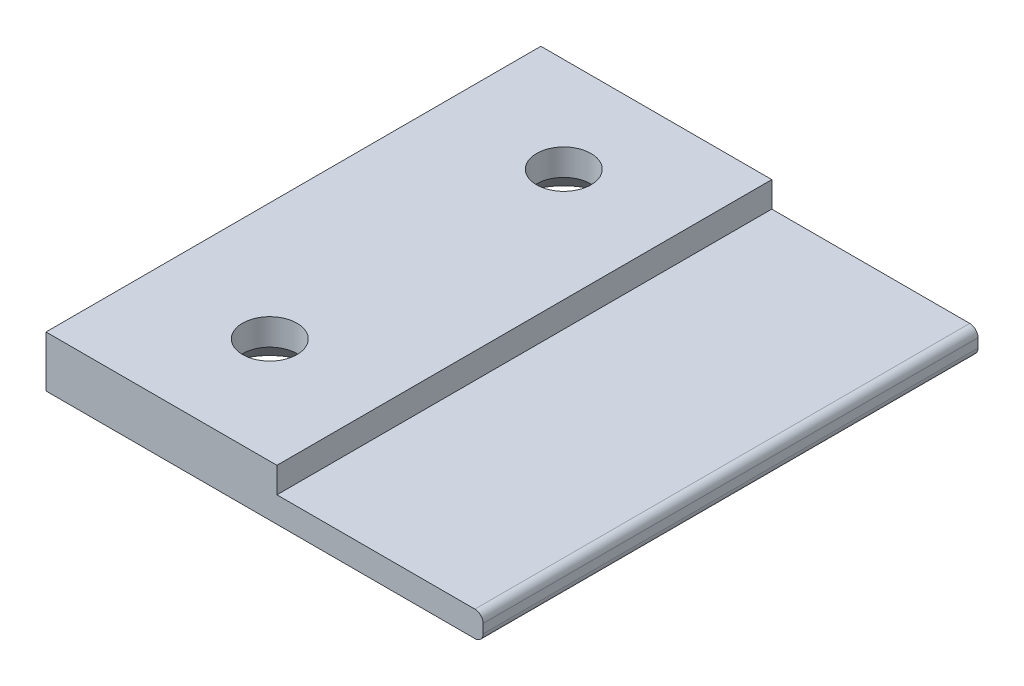
ISO-10303-21;
HEADER;
FILE_DESCRIPTION(('STEP AP214'),'2;1');
FILE_NAME('part.step','',(''),(''),'','','');
FILE_SCHEMA(('AUTOMOTIVE_DESIGN { 1 0 10303 214 1 1 1 1 }'));
ENDSEC;
DATA;
#1=APPLICATION_CONTEXT('core data for automotive mechanical design processes');
#2=APPLICATION_PROTOCOL_DEFINITION('international standard','automotive_design',2000,#1);
#3=PRODUCT_CONTEXT('',#1,'mechanical');
#4=PRODUCT('Part','Part','',(#3));
#5=PRODUCT_RELATED_PRODUCT_CATEGORY('part','',(#4));
#6=PRODUCT_DEFINITION_FORMATION('','',#4);
#7=PRODUCT_DEFINITION_CONTEXT('part definition',#1,'design');
#8=PRODUCT_DEFINITION('design','',#6,#7);
#9=PRODUCT_DEFINITION_SHAPE('','',#8);
#10=(LENGTH_UNIT() NAMED_UNIT(*) SI_UNIT(.MILLI.,.METRE.));
#11=(NAMED_UNIT(*) PLANE_ANGLE_UNIT() SI_UNIT($,.RADIAN.));
#12=(NAMED_UNIT(*) SI_UNIT($,.STERADIAN.) SOLID_ANGLE_UNIT());
#13=UNCERTAINTY_MEASURE_WITH_UNIT(LENGTH_MEASURE(1.E-05),#10,'distance_accuracy_value','');
#14=(GEOMETRIC_REPRESENTATION_CONTEXT(3) GLOBAL_UNCERTAINTY_ASSIGNED_CONTEXT((#13)) GLOBAL_UNIT_ASSIGNED_CONTEXT((#10,
#11,#12)) REPRESENTATION_CONTEXT('',''));
#15=CARTESIAN_POINT('',(0.,0.,0.));
#16=DIRECTION('',(0.,0.,1.));
#17=DIRECTION('',(1.,0.,0.));
#18=AXIS2_PLACEMENT_3D('',#15,#16,#17);
#19=CARTESIAN_POINT('',(0.,-6.2,60.));
#20=DIRECTION('',(1.,0.,0.));
#21=DIRECTION('',(0.,0.,-1.));
#22=AXIS2_PLACEMENT_3D('',#19,#20,#21);
#23=PLANE('',#22);
#24=DIRECTION('',(0.,-1.,0.));
#25=VECTOR('',#24,1.);
#26=CARTESIAN_POINT('',(0.,-6.2,0.));
#27=LINE('',#26,#25);
#28=CARTESIAN_POINT('',(0.,0.,0.));
#29=VERTEX_POINT('',#28);
#30=CARTESIAN_POINT('',(0.,-6.2,0.));
#31=VERTEX_POINT('',#30);
#32=EDGE_CURVE('E123',#29,#31,#27,.T.);
#33=ORIENTED_EDGE('',*,*,#32,.T.);
#34=DIRECTION('',(0.,0.,-1.));
#35=VECTOR('',#34,1.);
#36=CARTESIAN_POINT('',(0.,-6.2,60.));
#37=LINE('',#36,#35);
#38=CARTESIAN_POINT('',(0.,-6.2,60.));
#39=VERTEX_POINT('',#38);
#40=EDGE_CURVE('E106',#39,#31,#37,.T.);
#41=ORIENTED_EDGE('',*,*,#40,.F.);
#42=DIRECTION('',(0.,-1.,0.));
#43=VECTOR('',#42,1.);
#44=CARTESIAN_POINT('',(0.,-6.2,60.));
#45=LINE('',#44,#43);
#46=CARTESIAN_POINT('',(0.,0.,60.));
#47=VERTEX_POINT('',#46);
#48=EDGE_CURVE('E111',#47,#39,#45,.T.);
#49=ORIENTED_EDGE('',*,*,#48,.F.);
#50=DIRECTION('',(0.,0.,-1.));
#51=VECTOR('',#50,1.);
#52=CARTESIAN_POINT('',(0.,0.,60.));
#53=LINE('',#52,#51);
#54=EDGE_CURVE('E165',#47,#29,#53,.T.);
#55=ORIENTED_EDGE('',*,*,#54,.T.);
#56=EDGE_LOOP('',(#33,#41,#49,#55));
#57=FACE_BOUND('',#56,.T.);
#58=ADVANCED_FACE('F36',(#57),#23,.F.);
#59=CARTESIAN_POINT('',(53.,-6.2,60.));
#60=DIRECTION('',(0.,1.,0.));
#61=DIRECTION('',(0.,0.,1.));
#62=AXIS2_PLACEMENT_3D('',#59,#60,#61);
#63=PLANE('',#62);
#64=CARTESIAN_POINT('',(14.293755615536,-6.2,11.5151442867863));
#65=DIRECTION('',(0.,-1.,0.));
#66=DIRECTION('',(0.,0.,-1.));
#67=AXIS2_PLACEMENT_3D('',#64,#65,#66);
#68=CIRCLE('',#67,6.3);
#69=CARTESIAN_POINT('',(14.293755615536,-6.2,5.21514428678633));
#70=VERTEX_POINT('',#69);
#71=EDGE_CURVE('E249',#70,#70,#68,.T.);
#72=ORIENTED_EDGE('',*,*,#71,.F.);
#73=EDGE_LOOP('',(#72));
#74=FACE_BOUND('',#73,.T.);
#75=CARTESIAN_POINT('',(14.293755615536,-6.2,47.1589377928567));
#76=DIRECTION('',(0.,-1.,0.));
#77=DIRECTION('',(0.,0.,-1.));
#78=AXIS2_PLACEMENT_3D('',#75,#76,#77);
#79=CIRCLE('',#78,6.3);
#80=CARTESIAN_POINT('',(14.293755615536,-6.2,40.8589377928567));
#81=VERTEX_POINT('',#80);
#82=EDGE_CURVE('E152',#81,#81,#79,.T.);
#83=ORIENTED_EDGE('',*,*,#82,.F.);
#84=EDGE_LOOP('',(#83));
#85=FACE_BOUND('',#84,.T.);
#86=DIRECTION('',(1.,0.,0.));
#87=VECTOR('',#86,1.);
#88=CARTESIAN_POINT('',(53.,-6.2,0.));
#89=LINE('',#88,#87);
#90=CARTESIAN_POINT('',(52.,-6.2,0.));
#91=VERTEX_POINT('',#90);
#92=EDGE_CURVE('E149',#31,#91,#89,.T.);
#93=ORIENTED_EDGE('',*,*,#92,.T.);
#94=DIRECTION('',(0.,0.,-1.));
#95=VECTOR('',#94,1.);
#96=CARTESIAN_POINT('',(52.,-6.2,60.));
#97=LINE('',#96,#95);
#98=CARTESIAN_POINT('',(52.,-6.2,60.));
#99=VERTEX_POINT('',#98);
#100=EDGE_CURVE('E11',#91,#99,#97,.F.);
#101=ORIENTED_EDGE('',*,*,#100,.T.);
#102=DIRECTION('',(1.,0.,0.));
#103=VECTOR('',#102,1.);
#104=CARTESIAN_POINT('',(53.,-6.2,60.));
#105=LINE('',#104,#103);
#106=EDGE_CURVE('E102',#39,#99,#105,.T.);
#107=ORIENTED_EDGE('',*,*,#106,.F.);
#108=ORIENTED_EDGE('',*,*,#40,.T.);
#109=EDGE_LOOP('',(#93,#101,#107,#108));
#110=FACE_BOUND('',#109,.T.);
#111=ADVANCED_FACE('F104',(#74,#85,#110),#63,.F.);
#112=CARTESIAN_POINT('',(53.,-3.1,60.));
#113=DIRECTION('',(-1.,0.,0.));
#114=DIRECTION('',(0.,0.,1.));
#115=AXIS2_PLACEMENT_3D('',#112,#113,#114);
#116=PLANE('',#115);
#117=DIRECTION('',(0.,1.,0.));
#118=VECTOR('',#117,1.);
#119=CARTESIAN_POINT('',(53.,-3.1,0.));
#120=LINE('',#119,#118);
#121=CARTESIAN_POINT('',(53.,-5.2,0.));
#122=VERTEX_POINT('',#121);
#123=CARTESIAN_POINT('',(53.,-4.1,0.));
#124=VERTEX_POINT('',#123);
#125=EDGE_CURVE('E168',#122,#124,#120,.T.);
#126=ORIENTED_EDGE('',*,*,#125,.T.);
#127=DIRECTION('',(0.,0.,-1.));
#128=VECTOR('',#127,1.);
#129=CARTESIAN_POINT('',(53.,-4.1,60.));
#130=LINE('',#129,#128);
#131=CARTESIAN_POINT('',(53.,-4.1,60.));
#132=VERTEX_POINT('',#131);
#133=EDGE_CURVE('E59',#124,#132,#130,.F.);
#134=ORIENTED_EDGE('',*,*,#133,.T.);
#135=DIRECTION('',(0.,1.,0.));
#136=VECTOR('',#135,1.);
#137=CARTESIAN_POINT('',(53.,-3.1,60.));
#138=LINE('',#137,#136);
#139=CARTESIAN_POINT('',(53.,-5.2,60.));
#140=VERTEX_POINT('',#139);
#141=EDGE_CURVE('E110',#140,#132,#138,.T.);
#142=ORIENTED_EDGE('',*,*,#141,.F.);
#143=DIRECTION('',(0.,0.,-1.));
#144=VECTOR('',#143,1.);
#145=CARTESIAN_POINT('',(53.,-5.2,60.));
#146=LINE('',#145,#144);
#147=EDGE_CURVE('E138',#140,#122,#146,.T.);
#148=ORIENTED_EDGE('',*,*,#147,.T.);
#149=EDGE_LOOP('',(#126,#134,#142,#148));
#150=FACE_BOUND('',#149,.T.);
#151=ADVANCED_FACE('F190',(#150),#116,.F.);
#152=CARTESIAN_POINT('',(28.,-3.1,60.));
#153=DIRECTION('',(0.,-1.,0.));
#154=DIRECTION('',(0.,0.,-1.));
#155=AXIS2_PLACEMENT_3D('',#152,#153,#154);
#156=PLANE('',#155);
#157=DIRECTION('',(-1.,0.,0.));
#158=VECTOR('',#157,1.);
#159=CARTESIAN_POINT('',(28.,-3.1,60.));
#160=LINE('',#159,#158);
#161=CARTESIAN_POINT('',(52.,-3.1,60.));
#162=VERTEX_POINT('',#161);
#163=CARTESIAN_POINT('',(28.,-3.1,60.));
#164=VERTEX_POINT('',#163);
#165=EDGE_CURVE('E161',#162,#164,#160,.T.);
#166=ORIENTED_EDGE('',*,*,#165,.F.);
#167=DIRECTION('',(0.,0.,-1.));
#168=VECTOR('',#167,1.);
#169=CARTESIAN_POINT('',(52.,-3.1,60.));
#170=LINE('',#169,#168);
#171=CARTESIAN_POINT('',(52.,-3.1,0.));
#172=VERTEX_POINT('',#171);
#173=EDGE_CURVE('E124',#162,#172,#170,.T.);
#174=ORIENTED_EDGE('',*,*,#173,.T.);
#175=DIRECTION('',(-1.,0.,0.));
#176=VECTOR('',#175,1.);
#177=CARTESIAN_POINT('',(28.,-3.1,0.));
#178=LINE('',#177,#176);
#179=CARTESIAN_POINT('',(28.,-3.1,0.));
#180=VERTEX_POINT('',#179);
#181=EDGE_CURVE('E170',#172,#180,#178,.T.);
#182=ORIENTED_EDGE('',*,*,#181,.T.);
#183=DIRECTION('',(0.,0.,-1.));
#184=VECTOR('',#183,1.);
#185=CARTESIAN_POINT('',(28.,-3.1,60.));
#186=LINE('',#185,#184);
#187=EDGE_CURVE('E125',#164,#180,#186,.T.);
#188=ORIENTED_EDGE('',*,*,#187,.F.);
#189=EDGE_LOOP('',(#166,#174,#182,#188));
#190=FACE_BOUND('',#189,.T.);
#191=ADVANCED_FACE('F196',(#190),#156,.F.);
#192=CARTESIAN_POINT('',(28.,0.,60.));
#193=DIRECTION('',(-1.,0.,0.));
#194=DIRECTION('',(0.,0.,1.));
#195=AXIS2_PLACEMENT_3D('',#192,#193,#194);
#196=PLANE('',#195);
#197=DIRECTION('',(0.,1.,0.));
#198=VECTOR('',#197,1.);
#199=CARTESIAN_POINT('',(28.,0.,0.));
#200=LINE('',#199,#198);
#201=CARTESIAN_POINT('',(28.,0.,0.));
#202=VERTEX_POINT('',#201);
#203=EDGE_CURVE('E172',#180,#202,#200,.T.);
#204=ORIENTED_EDGE('',*,*,#203,.T.);
#205=DIRECTION('',(0.,0.,-1.));
#206=VECTOR('',#205,1.);
#207=CARTESIAN_POINT('',(28.,0.,60.));
#208=LINE('',#207,#206);
#209=CARTESIAN_POINT('',(28.,0.,60.));
#210=VERTEX_POINT('',#209);
#211=EDGE_CURVE('E131',#210,#202,#208,.T.);
#212=ORIENTED_EDGE('',*,*,#211,.F.);
#213=DIRECTION('',(0.,1.,0.));
#214=VECTOR('',#213,1.);
#215=CARTESIAN_POINT('',(28.,0.,60.));
#216=LINE('',#215,#214);
#217=EDGE_CURVE('E163',#164,#210,#216,.T.);
#218=ORIENTED_EDGE('',*,*,#217,.F.);
#219=ORIENTED_EDGE('',*,*,#187,.T.);
#220=EDGE_LOOP('',(#204,#212,#218,#219));
#221=FACE_BOUND('',#220,.T.);
#222=ADVANCED_FACE('F198',(#221),#196,.F.);
#223=CARTESIAN_POINT('',(0.,0.,60.));
#224=DIRECTION('',(0.,-1.,0.));
#225=DIRECTION('',(0.,0.,-1.));
#226=AXIS2_PLACEMENT_3D('',#223,#224,#225);
#227=PLANE('',#226);
#228=CARTESIAN_POINT('',(14.293755615536,0.,11.5151442867863));
#229=DIRECTION('',(0.,-1.,0.));
#230=DIRECTION('',(0.,0.,-1.));
#231=AXIS2_PLACEMENT_3D('',#228,#229,#230);
#232=CIRCLE('',#231,3.3);
#233=CARTESIAN_POINT('',(14.293755615536,0.,8.21514428678634));
#234=VERTEX_POINT('',#233);
#235=EDGE_CURVE('E40',#234,#234,#232,.T.);
#236=ORIENTED_EDGE('',*,*,#235,.T.);
#237=EDGE_LOOP('',(#236));
#238=FACE_BOUND('',#237,.T.);
#239=CARTESIAN_POINT('',(14.293755615536,0.,47.1589377928567));
#240=DIRECTION('',(0.,-1.,0.));
#241=DIRECTION('',(0.,0.,-1.));
#242=AXIS2_PLACEMENT_3D('',#239,#240,#241);
#243=CIRCLE('',#242,3.3);
#244=CARTESIAN_POINT('',(14.293755615536,0.,43.8589377928567));
#245=VERTEX_POINT('',#244);
#246=EDGE_CURVE('E144',#245,#245,#243,.T.);
#247=ORIENTED_EDGE('',*,*,#246,.T.);
#248=EDGE_LOOP('',(#247));
#249=FACE_BOUND('',#248,.T.);
#250=DIRECTION('',(-1.,0.,0.));
#251=VECTOR('',#250,1.);
#252=CARTESIAN_POINT('',(0.,0.,0.));
#253=LINE('',#252,#251);
#254=EDGE_CURVE('E120',#202,#29,#253,.T.);
#255=ORIENTED_EDGE('',*,*,#254,.T.);
#256=ORIENTED_EDGE('',*,*,#54,.F.);
#257=DIRECTION('',(-1.,0.,0.));
#258=VECTOR('',#257,1.);
#259=CARTESIAN_POINT('',(0.,0.,60.));
#260=LINE('',#259,#258);
#261=EDGE_CURVE('E116',#210,#47,#260,.T.);
#262=ORIENTED_EDGE('',*,*,#261,.F.);
#263=ORIENTED_EDGE('',*,*,#211,.T.);
#264=EDGE_LOOP('',(#255,#256,#262,#263));
#265=FACE_BOUND('',#264,.T.);
#266=ADVANCED_FACE('F179',(#238,#249,#265),#227,.F.);
#267=CARTESIAN_POINT('',(0.,0.,60.));
#268=DIRECTION('',(0.,0.,-1.));
#269=DIRECTION('',(-1.,0.,0.));
#270=AXIS2_PLACEMENT_3D('',#267,#268,#269);
#271=PLANE('',#270);
#272=ORIENTED_EDGE('',*,*,#141,.T.);
#273=CARTESIAN_POINT('',(52.,-4.1,60.));
#274=DIRECTION('',(0.,0.,-1.));
#275=DIRECTION('',(-1.,0.,0.));
#276=AXIS2_PLACEMENT_3D('',#273,#274,#275);
#277=CIRCLE('',#276,1.);
#278=EDGE_CURVE('E45',#132,#162,#277,.F.);
#279=ORIENTED_EDGE('',*,*,#278,.T.);
#280=ORIENTED_EDGE('',*,*,#165,.T.);
#281=ORIENTED_EDGE('',*,*,#217,.T.);
#282=ORIENTED_EDGE('',*,*,#261,.T.);
#283=ORIENTED_EDGE('',*,*,#48,.T.);
#284=ORIENTED_EDGE('',*,*,#106,.T.);
#285=CARTESIAN_POINT('',(52.,-5.2,60.));
#286=DIRECTION('',(0.,0.,-1.));
#287=DIRECTION('',(-1.,0.,0.));
#288=AXIS2_PLACEMENT_3D('',#285,#286,#287);
#289=CIRCLE('',#288,1.);
#290=EDGE_CURVE('E142',#99,#140,#289,.F.);
#291=ORIENTED_EDGE('',*,*,#290,.T.);
#292=EDGE_LOOP('',(#272,#279,#280,#281,#282,#283,#284,#291));
#293=FACE_BOUND('',#292,.T.);
#294=ADVANCED_FACE('F114',(#293),#271,.F.);
#295=CARTESIAN_POINT('',(0.,0.,0.));
#296=DIRECTION('',(0.,0.,-1.));
#297=DIRECTION('',(-1.,0.,0.));
#298=AXIS2_PLACEMENT_3D('',#295,#296,#297);
#299=PLANE('',#298);
#300=ORIENTED_EDGE('',*,*,#181,.F.);
#301=CARTESIAN_POINT('',(52.,-4.1,0.));
#302=DIRECTION('',(0.,0.,-1.));
#303=DIRECTION('',(-1.,0.,0.));
#304=AXIS2_PLACEMENT_3D('',#301,#302,#303);
#305=CIRCLE('',#304,1.);
#306=EDGE_CURVE('E136',#172,#124,#305,.T.);
#307=ORIENTED_EDGE('',*,*,#306,.T.);
#308=ORIENTED_EDGE('',*,*,#125,.F.);
#309=CARTESIAN_POINT('',(52.,-5.2,0.));
#310=DIRECTION('',(0.,0.,-1.));
#311=DIRECTION('',(-1.,0.,0.));
#312=AXIS2_PLACEMENT_3D('',#309,#310,#311);
#313=CIRCLE('',#312,1.);
#314=EDGE_CURVE('E128',#122,#91,#313,.T.);
#315=ORIENTED_EDGE('',*,*,#314,.T.);
#316=ORIENTED_EDGE('',*,*,#92,.F.);
#317=ORIENTED_EDGE('',*,*,#32,.F.);
#318=ORIENTED_EDGE('',*,*,#254,.F.);
#319=ORIENTED_EDGE('',*,*,#203,.F.);
#320=EDGE_LOOP('',(#300,#307,#308,#315,#316,#317,#318,#319));
#321=FACE_BOUND('',#320,.T.);
#322=ADVANCED_FACE('F185',(#321),#299,.T.);
#323=CARTESIAN_POINT('',(52.,-4.1,60.));
#324=DIRECTION('',(0.,0.,-1.));
#325=DIRECTION('',(-1.,0.,0.));
#326=AXIS2_PLACEMENT_3D('',#323,#324,#325);
#327=CYLINDRICAL_SURFACE('',#326,1.);
#328=ORIENTED_EDGE('',*,*,#278,.F.);
#329=ORIENTED_EDGE('',*,*,#133,.F.);
#330=ORIENTED_EDGE('',*,*,#306,.F.);
#331=ORIENTED_EDGE('',*,*,#173,.F.);
#332=EDGE_LOOP('',(#328,#329,#330,#331));
#333=FACE_BOUND('',#332,.T.);
#334=ADVANCED_FACE('F193',(#333),#327,.T.);
#335=CARTESIAN_POINT('',(52.,-5.2,60.));
#336=DIRECTION('',(0.,0.,-1.));
#337=DIRECTION('',(-1.,0.,0.));
#338=AXIS2_PLACEMENT_3D('',#335,#336,#337);
#339=CYLINDRICAL_SURFACE('',#338,1.);
#340=ORIENTED_EDGE('',*,*,#290,.F.);
#341=ORIENTED_EDGE('',*,*,#100,.F.);
#342=ORIENTED_EDGE('',*,*,#314,.F.);
#343=ORIENTED_EDGE('',*,*,#147,.F.);
#344=EDGE_LOOP('',(#340,#341,#342,#343));
#345=FACE_BOUND('',#344,.T.);
#346=ADVANCED_FACE('F38',(#345),#339,.T.);
#347=CARTESIAN_POINT('',(14.293755615536,-6.2,47.1589377928567));
#348=DIRECTION('',(0.,-1.,0.));
#349=DIRECTION('',(0.,0.,-1.));
#350=AXIS2_PLACEMENT_3D('',#347,#348,#349);
#351=CYLINDRICAL_SURFACE('',#350,3.3);
#352=CARTESIAN_POINT('',(14.293755615536,-3.2,47.1589377928567));
#353=DIRECTION('',(0.,-1.,0.));
#354=DIRECTION('',(0.,0.,-1.));
#355=AXIS2_PLACEMENT_3D('',#352,#353,#354);
#356=CIRCLE('',#355,3.29999999999999);
#357=CARTESIAN_POINT('',(14.293755615536,-3.2,43.8589377928567));
#358=VERTEX_POINT('',#357);
#359=EDGE_CURVE('E146',#358,#358,#356,.T.);
#360=ORIENTED_EDGE('',*,*,#359,.T.);
#361=EDGE_LOOP('',(#360));
#362=FACE_BOUND('',#361,.T.);
#363=ORIENTED_EDGE('',*,*,#246,.F.);
#364=EDGE_LOOP('',(#363));
#365=FACE_BOUND('',#364,.T.);
#366=ADVANCED_FACE('F221',(#362,#365),#351,.F.);
#367=CARTESIAN_POINT('',(14.293755615536,-6.2,47.1589377928567));
#368=DIRECTION('',(0.,-1.,0.));
#369=DIRECTION('',(0.,0.,-1.));
#370=AXIS2_PLACEMENT_3D('',#367,#368,#369);
#371=CONICAL_SURFACE('',#370,6.3,0.785398163397449);
#372=ORIENTED_EDGE('',*,*,#359,.F.);
#373=EDGE_LOOP('',(#372));
#374=FACE_BOUND('',#373,.T.);
#375=ORIENTED_EDGE('',*,*,#82,.T.);
#376=EDGE_LOOP('',(#375));
#377=FACE_BOUND('',#376,.T.);
#378=ADVANCED_FACE('F230',(#374,#377),#371,.F.);
#379=CARTESIAN_POINT('',(14.293755615536,-6.2,11.5151442867863));
#380=DIRECTION('',(0.,-1.,0.));
#381=DIRECTION('',(0.,0.,-1.));
#382=AXIS2_PLACEMENT_3D('',#379,#380,#381);
#383=CYLINDRICAL_SURFACE('',#382,3.3);
#384=CARTESIAN_POINT('',(14.293755615536,-3.2,11.5151442867863));
#385=DIRECTION('',(0.,-1.,0.));
#386=DIRECTION('',(0.,0.,-1.));
#387=AXIS2_PLACEMENT_3D('',#384,#385,#386);
#388=CIRCLE('',#387,3.29999999999999);
#389=CARTESIAN_POINT('',(14.293755615536,-3.2,8.21514428678634));
#390=VERTEX_POINT('',#389);
#391=EDGE_CURVE('E246',#390,#390,#388,.T.);
#392=ORIENTED_EDGE('',*,*,#391,.T.);
#393=EDGE_LOOP('',(#392));
#394=FACE_BOUND('',#393,.T.);
#395=ORIENTED_EDGE('',*,*,#235,.F.);
#396=EDGE_LOOP('',(#395));
#397=FACE_BOUND('',#396,.T.);
#398=ADVANCED_FACE('F233',(#394,#397),#383,.F.);
#399=CARTESIAN_POINT('',(14.293755615536,-6.2,11.5151442867863));
#400=DIRECTION('',(0.,-1.,0.));
#401=DIRECTION('',(0.,0.,-1.));
#402=AXIS2_PLACEMENT_3D('',#399,#400,#401);
#403=CONICAL_SURFACE('',#402,6.3,0.785398163397449);
#404=ORIENTED_EDGE('',*,*,#391,.F.);
#405=EDGE_LOOP('',(#404));
#406=FACE_BOUND('',#405,.T.);
#407=ORIENTED_EDGE('',*,*,#71,.T.);
#408=EDGE_LOOP('',(#407));
#409=FACE_BOUND('',#408,.T.);
#410=ADVANCED_FACE('F237',(#406,#409),#403,.F.);
#411=CLOSED_SHELL('',(#58,#111,#151,#191,#222,#266,#294,#322,#334,#346,#366,#378,#398,#410));
#412=MANIFOLD_SOLID_BREP('B2',#411);
#413=ADVANCED_BREP_SHAPE_REPRESENTATION('',(#18,#412),#14);
#414=SHAPE_DEFINITION_REPRESENTATION(#9,#413);
ENDSEC;
END-ISO-10303-21;
